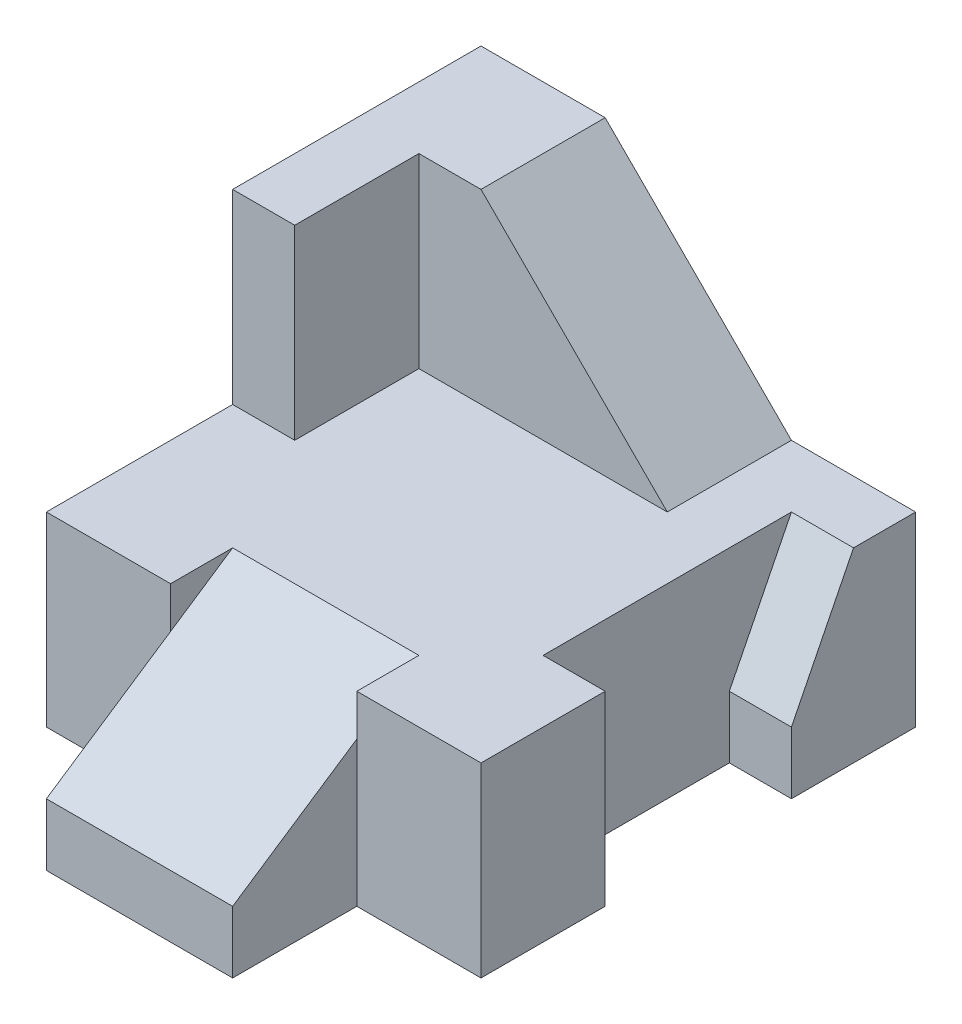
ISO-10303-21;
HEADER;
FILE_DESCRIPTION(('STEP AP214'),'2;1');
FILE_NAME('part.step','',(''),(''),'','','');
FILE_SCHEMA(('AUTOMOTIVE_DESIGN { 1 0 10303 214 1 1 1 1 }'));
ENDSEC;
DATA;
#1=APPLICATION_CONTEXT('core data for automotive mechanical design processes');
#2=APPLICATION_PROTOCOL_DEFINITION('international standard','automotive_design',2000,#1);
#3=PRODUCT_CONTEXT('',#1,'mechanical');
#4=PRODUCT('Part','Part','',(#3));
#5=PRODUCT_RELATED_PRODUCT_CATEGORY('part','',(#4));
#6=PRODUCT_DEFINITION_FORMATION('','',#4);
#7=PRODUCT_DEFINITION_CONTEXT('part definition',#1,'design');
#8=PRODUCT_DEFINITION('design','',#6,#7);
#9=PRODUCT_DEFINITION_SHAPE('','',#8);
#10=(LENGTH_UNIT() NAMED_UNIT(*) SI_UNIT(.MILLI.,.METRE.));
#11=(NAMED_UNIT(*) PLANE_ANGLE_UNIT() SI_UNIT($,.RADIAN.));
#12=(NAMED_UNIT(*) SI_UNIT($,.STERADIAN.) SOLID_ANGLE_UNIT());
#13=UNCERTAINTY_MEASURE_WITH_UNIT(LENGTH_MEASURE(1.E-05),#10,'distance_accuracy_value','');
#14=(GEOMETRIC_REPRESENTATION_CONTEXT(3) GLOBAL_UNCERTAINTY_ASSIGNED_CONTEXT((#13)) GLOBAL_UNIT_ASSIGNED_CONTEXT((#10,
#11,#12)) REPRESENTATION_CONTEXT('',''));
#15=CARTESIAN_POINT('',(0.,0.,0.));
#16=DIRECTION('',(0.,0.,1.));
#17=DIRECTION('',(1.,0.,0.));
#18=AXIS2_PLACEMENT_3D('',#15,#16,#17);
#19=CARTESIAN_POINT('',(0.,0.,9.));
#20=DIRECTION('',(0.,0.,1.));
#21=DIRECTION('',(1.,0.,0.));
#22=AXIS2_PLACEMENT_3D('',#19,#20,#21);
#23=PLANE('',#22);
#24=DIRECTION('',(0.,1.,0.));
#25=VECTOR('',#24,1.);
#26=CARTESIAN_POINT('',(1.5,-3.,9.));
#27=LINE('',#26,#25);
#28=CARTESIAN_POINT('',(1.5,-3.,9.));
#29=VERTEX_POINT('',#28);
#30=CARTESIAN_POINT('',(1.5,-2.,9.));
#31=VERTEX_POINT('',#30);
#32=EDGE_CURVE('E229',#29,#31,#27,.T.);
#33=ORIENTED_EDGE('',*,*,#32,.T.);
#34=DIRECTION('',(1.,0.,0.));
#35=VECTOR('',#34,1.);
#36=CARTESIAN_POINT('',(-1.5,-2.,9.));
#37=LINE('',#36,#35);
#38=CARTESIAN_POINT('',(-1.5,-2.,9.));
#39=VERTEX_POINT('',#38);
#40=EDGE_CURVE('E184',#39,#31,#37,.T.);
#41=ORIENTED_EDGE('',*,*,#40,.F.);
#42=DIRECTION('',(0.,1.,0.));
#43=VECTOR('',#42,1.);
#44=CARTESIAN_POINT('',(-1.5,-3.,9.));
#45=LINE('',#44,#43);
#46=CARTESIAN_POINT('',(-1.5,-3.,9.));
#47=VERTEX_POINT('',#46);
#48=EDGE_CURVE('E215',#47,#39,#45,.T.);
#49=ORIENTED_EDGE('',*,*,#48,.F.);
#50=DIRECTION('',(1.,0.,0.));
#51=VECTOR('',#50,1.);
#52=CARTESIAN_POINT('',(3.5,-3.,9.));
#53=LINE('',#52,#51);
#54=EDGE_CURVE('E201',#47,#29,#53,.T.);
#55=ORIENTED_EDGE('',*,*,#54,.T.);
#56=EDGE_LOOP('',(#33,#41,#49,#55));
#57=FACE_BOUND('',#56,.T.);
#58=ADVANCED_FACE('F34',(#57),#23,.T.);
#59=CARTESIAN_POINT('',(-1.5,-3.,7.));
#60=DIRECTION('',(1.,0.,0.));
#61=DIRECTION('',(0.,1.,0.));
#62=AXIS2_PLACEMENT_3D('',#59,#60,#61);
#63=PLANE('',#62);
#64=DIRECTION('',(0.,-0.554700196225229,0.832050294337843));
#65=VECTOR('',#64,1.);
#66=CARTESIAN_POINT('',(-1.5,0.,6.));
#67=LINE('',#66,#65);
#68=CARTESIAN_POINT('',(-1.5,-0.666666666666666,7.));
#69=VERTEX_POINT('',#68);
#70=EDGE_CURVE('E177',#69,#39,#67,.T.);
#71=ORIENTED_EDGE('',*,*,#70,.F.);
#72=DIRECTION('',(0.,1.,0.));
#73=VECTOR('',#72,1.);
#74=CARTESIAN_POINT('',(-1.5,-3.,7.));
#75=LINE('',#74,#73);
#76=CARTESIAN_POINT('',(-1.5,-3.,7.));
#77=VERTEX_POINT('',#76);
#78=EDGE_CURVE('E218',#77,#69,#75,.T.);
#79=ORIENTED_EDGE('',*,*,#78,.F.);
#80=DIRECTION('',(0.,0.,-1.));
#81=VECTOR('',#80,1.);
#82=CARTESIAN_POINT('',(-1.5,-3.,7.));
#83=LINE('',#82,#81);
#84=EDGE_CURVE('E226',#47,#77,#83,.T.);
#85=ORIENTED_EDGE('',*,*,#84,.F.);
#86=ORIENTED_EDGE('',*,*,#48,.T.);
#87=EDGE_LOOP('',(#71,#79,#85,#86));
#88=FACE_BOUND('',#87,.T.);
#89=ADVANCED_FACE('F390',(#88),#63,.F.);
#90=CARTESIAN_POINT('',(1.5,-3.,7.));
#91=DIRECTION('',(-1.,0.,0.));
#92=DIRECTION('',(0.,-1.,0.));
#93=AXIS2_PLACEMENT_3D('',#90,#91,#92);
#94=PLANE('',#93);
#95=DIRECTION('',(0.,0.554700196225229,-0.832050294337843));
#96=VECTOR('',#95,1.);
#97=CARTESIAN_POINT('',(1.5,-2.,9.));
#98=LINE('',#97,#96);
#99=CARTESIAN_POINT('',(1.5,-0.666666666666666,7.));
#100=VERTEX_POINT('',#99);
#101=EDGE_CURVE('E178',#31,#100,#98,.T.);
#102=ORIENTED_EDGE('',*,*,#101,.F.);
#103=ORIENTED_EDGE('',*,*,#32,.F.);
#104=DIRECTION('',(0.,0.,1.));
#105=VECTOR('',#104,1.);
#106=CARTESIAN_POINT('',(1.5,-3.,7.));
#107=LINE('',#106,#105);
#108=CARTESIAN_POINT('',(1.5,-3.,7.));
#109=VERTEX_POINT('',#108);
#110=EDGE_CURVE('E234',#109,#29,#107,.T.);
#111=ORIENTED_EDGE('',*,*,#110,.F.);
#112=DIRECTION('',(0.,1.,0.));
#113=VECTOR('',#112,1.);
#114=CARTESIAN_POINT('',(1.5,-3.,7.));
#115=LINE('',#114,#113);
#116=EDGE_CURVE('E233',#109,#100,#115,.T.);
#117=ORIENTED_EDGE('',*,*,#116,.T.);
#118=EDGE_LOOP('',(#102,#103,#111,#117));
#119=FACE_BOUND('',#118,.T.);
#120=ADVANCED_FACE('F335',(#119),#94,.F.);
#121=CARTESIAN_POINT('',(0.,0.,4.5));
#122=DIRECTION('',(0.,1.,0.));
#123=DIRECTION('',(-1.,0.,0.));
#124=AXIS2_PLACEMENT_3D('',#121,#122,#123);
#125=PLANE('',#124);
#126=DIRECTION('',(-1.,0.,0.));
#127=VECTOR('',#126,1.);
#128=CARTESIAN_POINT('',(1.5,0.,6.));
#129=LINE('',#128,#127);
#130=CARTESIAN_POINT('',(1.5,0.,6.));
#131=VERTEX_POINT('',#130);
#132=CARTESIAN_POINT('',(-1.5,0.,6.));
#133=VERTEX_POINT('',#132);
#134=EDGE_CURVE('E171',#131,#133,#129,.T.);
#135=ORIENTED_EDGE('',*,*,#134,.F.);
#136=DIRECTION('',(0.,0.,1.));
#137=VECTOR('',#136,1.);
#138=CARTESIAN_POINT('',(1.5,0.,4.5));
#139=LINE('',#138,#137);
#140=CARTESIAN_POINT('',(1.5,0.,7.));
#141=VERTEX_POINT('',#140);
#142=EDGE_CURVE('E12',#131,#141,#139,.T.);
#143=ORIENTED_EDGE('',*,*,#142,.T.);
#144=DIRECTION('',(1.,0.,0.));
#145=VECTOR('',#144,1.);
#146=CARTESIAN_POINT('',(3.5,0.,7.));
#147=LINE('',#146,#145);
#148=CARTESIAN_POINT('',(3.5,0.,7.));
#149=VERTEX_POINT('',#148);
#150=EDGE_CURVE('E271',#141,#149,#147,.T.);
#151=ORIENTED_EDGE('',*,*,#150,.T.);
#152=DIRECTION('',(0.,0.,-1.));
#153=VECTOR('',#152,1.);
#154=CARTESIAN_POINT('',(3.5,0.,9.));
#155=LINE('',#154,#153);
#156=CARTESIAN_POINT('',(3.5,0.,5.));
#157=VERTEX_POINT('',#156);
#158=EDGE_CURVE('E273',#149,#157,#155,.T.);
#159=ORIENTED_EDGE('',*,*,#158,.T.);
#160=DIRECTION('',(-1.,0.,0.));
#161=VECTOR('',#160,1.);
#162=CARTESIAN_POINT('',(2.5,0.,5.));
#163=LINE('',#162,#161);
#164=CARTESIAN_POINT('',(2.5,0.,5.));
#165=VERTEX_POINT('',#164);
#166=EDGE_CURVE('E277',#157,#165,#163,.T.);
#167=ORIENTED_EDGE('',*,*,#166,.T.);
#168=DIRECTION('',(0.,0.,-1.));
#169=VECTOR('',#168,1.);
#170=CARTESIAN_POINT('',(2.5,0.,2.));
#171=LINE('',#170,#169);
#172=CARTESIAN_POINT('',(2.5,0.,1.));
#173=VERTEX_POINT('',#172);
#174=EDGE_CURVE('E57',#165,#173,#171,.T.);
#175=ORIENTED_EDGE('',*,*,#174,.T.);
#176=DIRECTION('',(1.,0.,0.));
#177=VECTOR('',#176,1.);
#178=CARTESIAN_POINT('',(2.5,0.,1.));
#179=LINE('',#178,#177);
#180=CARTESIAN_POINT('',(3.5,0.,1.));
#181=VERTEX_POINT('',#180);
#182=EDGE_CURVE('E314',#173,#181,#179,.T.);
#183=ORIENTED_EDGE('',*,*,#182,.T.);
#184=DIRECTION('',(0.,0.,-1.));
#185=VECTOR('',#184,1.);
#186=CARTESIAN_POINT('',(3.5,0.,9.));
#187=LINE('',#186,#185);
#188=CARTESIAN_POINT('',(3.5,0.,0.));
#189=VERTEX_POINT('',#188);
#190=EDGE_CURVE('E275',#181,#189,#187,.T.);
#191=ORIENTED_EDGE('',*,*,#190,.T.);
#192=DIRECTION('',(-1.,0.,0.));
#193=VECTOR('',#192,1.);
#194=CARTESIAN_POINT('',(0.,0.,0.));
#195=LINE('',#194,#193);
#196=CARTESIAN_POINT('',(1.5,0.,0.));
#197=VERTEX_POINT('',#196);
#198=EDGE_CURVE('E268',#189,#197,#195,.T.);
#199=ORIENTED_EDGE('',*,*,#198,.T.);
#200=DIRECTION('',(0.,0.,-1.));
#201=VECTOR('',#200,1.);
#202=CARTESIAN_POINT('',(1.5,0.,0.));
#203=LINE('',#202,#201);
#204=CARTESIAN_POINT('',(1.5,0.,2.));
#205=VERTEX_POINT('',#204);
#206=EDGE_CURVE('E285',#205,#197,#203,.T.);
#207=ORIENTED_EDGE('',*,*,#206,.F.);
#208=DIRECTION('',(1.,0.,0.));
#209=VECTOR('',#208,1.);
#210=CARTESIAN_POINT('',(1.5,0.,2.));
#211=LINE('',#210,#209);
#212=CARTESIAN_POINT('',(-2.5,0.,2.));
#213=VERTEX_POINT('',#212);
#214=EDGE_CURVE('E300',#213,#205,#211,.T.);
#215=ORIENTED_EDGE('',*,*,#214,.F.);
#216=DIRECTION('',(0.,0.,-1.));
#217=VECTOR('',#216,1.);
#218=CARTESIAN_POINT('',(-2.5,0.,2.));
#219=LINE('',#218,#217);
#220=CARTESIAN_POINT('',(-2.5,0.,4.));
#221=VERTEX_POINT('',#220);
#222=EDGE_CURVE('E303',#221,#213,#219,.T.);
#223=ORIENTED_EDGE('',*,*,#222,.F.);
#224=DIRECTION('',(1.,0.,0.));
#225=VECTOR('',#224,1.);
#226=CARTESIAN_POINT('',(-2.5,0.,4.));
#227=LINE('',#226,#225);
#228=CARTESIAN_POINT('',(-3.5,0.,4.));
#229=VERTEX_POINT('',#228);
#230=EDGE_CURVE('E291',#229,#221,#227,.T.);
#231=ORIENTED_EDGE('',*,*,#230,.F.);
#232=DIRECTION('',(0.,0.,1.));
#233=VECTOR('',#232,1.);
#234=CARTESIAN_POINT('',(-3.5,0.,9.));
#235=LINE('',#234,#233);
#236=CARTESIAN_POINT('',(-3.5,0.,7.));
#237=VERTEX_POINT('',#236);
#238=EDGE_CURVE('E265',#229,#237,#235,.T.);
#239=ORIENTED_EDGE('',*,*,#238,.T.);
#240=DIRECTION('',(1.,0.,0.));
#241=VECTOR('',#240,1.);
#242=CARTESIAN_POINT('',(-3.5,0.,7.));
#243=LINE('',#242,#241);
#244=CARTESIAN_POINT('',(-1.5,0.,7.));
#245=VERTEX_POINT('',#244);
#246=EDGE_CURVE('E189',#237,#245,#243,.T.);
#247=ORIENTED_EDGE('',*,*,#246,.T.);
#248=DIRECTION('',(0.,0.,-1.));
#249=VECTOR('',#248,1.);
#250=CARTESIAN_POINT('',(-1.5,0.,4.5));
#251=LINE('',#250,#249);
#252=EDGE_CURVE('E42',#245,#133,#251,.T.);
#253=ORIENTED_EDGE('',*,*,#252,.T.);
#254=EDGE_LOOP('',(#135,#143,#151,#159,#167,#175,#183,#191,#199,#207,#215,#223,#231,#239,#247,#253));
#255=FACE_BOUND('',#254,.T.);
#256=ADVANCED_FACE('F187',(#255),#125,.T.);
#257=CARTESIAN_POINT('',(3.5,-3.,9.));
#258=DIRECTION('',(-1.,0.,0.));
#259=DIRECTION('',(0.,0.,1.));
#260=AXIS2_PLACEMENT_3D('',#257,#258,#259);
#261=PLANE('',#260);
#262=ORIENTED_EDGE('',*,*,#158,.F.);
#263=DIRECTION('',(0.,1.,0.));
#264=VECTOR('',#263,1.);
#265=CARTESIAN_POINT('',(3.5,-3.,7.));
#266=LINE('',#265,#264);
#267=CARTESIAN_POINT('',(3.5,-3.,7.));
#268=VERTEX_POINT('',#267);
#269=EDGE_CURVE('E230',#268,#149,#266,.T.);
#270=ORIENTED_EDGE('',*,*,#269,.F.);
#271=DIRECTION('',(0.,0.,-1.));
#272=VECTOR('',#271,1.);
#273=CARTESIAN_POINT('',(3.5,-3.,9.));
#274=LINE('',#273,#272);
#275=CARTESIAN_POINT('',(3.5,-3.,5.));
#276=VERTEX_POINT('',#275);
#277=EDGE_CURVE('E192',#268,#276,#274,.T.);
#278=ORIENTED_EDGE('',*,*,#277,.T.);
#279=DIRECTION('',(0.,1.,0.));
#280=VECTOR('',#279,1.);
#281=CARTESIAN_POINT('',(3.5,-3.,5.));
#282=LINE('',#281,#280);
#283=EDGE_CURVE('E244',#276,#157,#282,.T.);
#284=ORIENTED_EDGE('',*,*,#283,.T.);
#285=EDGE_LOOP('',(#262,#270,#278,#284));
#286=FACE_BOUND('',#285,.T.);
#287=ADVANCED_FACE('F343',(#286),#261,.F.);
#288=CARTESIAN_POINT('',(-3.5,-3.,9.));
#289=DIRECTION('',(1.,0.,0.));
#290=DIRECTION('',(0.,0.,-1.));
#291=AXIS2_PLACEMENT_3D('',#288,#289,#290);
#292=PLANE('',#291);
#293=DIRECTION('',(0.,-1.,0.));
#294=VECTOR('',#293,1.);
#295=CARTESIAN_POINT('',(-3.5,-3.,0.));
#296=LINE('',#295,#294);
#297=CARTESIAN_POINT('',(-3.5,3.,0.));
#298=VERTEX_POINT('',#297);
#299=CARTESIAN_POINT('',(-3.5,-3.,0.));
#300=VERTEX_POINT('',#299);
#301=EDGE_CURVE('E210',#298,#300,#296,.T.);
#302=ORIENTED_EDGE('',*,*,#301,.T.);
#303=DIRECTION('',(0.,0.,-1.));
#304=VECTOR('',#303,1.);
#305=CARTESIAN_POINT('',(-3.5,-3.,9.));
#306=LINE('',#305,#304);
#307=CARTESIAN_POINT('',(-3.5,-3.,7.));
#308=VERTEX_POINT('',#307);
#309=EDGE_CURVE('E190',#308,#300,#306,.T.);
#310=ORIENTED_EDGE('',*,*,#309,.F.);
#311=DIRECTION('',(0.,1.,0.));
#312=VECTOR('',#311,1.);
#313=CARTESIAN_POINT('',(-3.5,-3.,7.));
#314=LINE('',#313,#312);
#315=EDGE_CURVE('E212',#308,#237,#314,.T.);
#316=ORIENTED_EDGE('',*,*,#315,.T.);
#317=ORIENTED_EDGE('',*,*,#238,.F.);
#318=DIRECTION('',(0.,1.,0.));
#319=VECTOR('',#318,1.);
#320=CARTESIAN_POINT('',(-3.5,0.,4.));
#321=LINE('',#320,#319);
#322=CARTESIAN_POINT('',(-3.5,3.,4.));
#323=VERTEX_POINT('',#322);
#324=EDGE_CURVE('E281',#229,#323,#321,.T.);
#325=ORIENTED_EDGE('',*,*,#324,.T.);
#326=DIRECTION('',(0.,0.,-1.));
#327=VECTOR('',#326,1.);
#328=CARTESIAN_POINT('',(-3.5,3.,9.));
#329=LINE('',#328,#327);
#330=EDGE_CURVE('E198',#323,#298,#329,.T.);
#331=ORIENTED_EDGE('',*,*,#330,.T.);
#332=EDGE_LOOP('',(#302,#310,#316,#317,#325,#331));
#333=FACE_BOUND('',#332,.T.);
#334=ADVANCED_FACE('F36',(#333),#292,.F.);
#335=ORIENTED_EDGE('',*,*,#190,.F.);
#336=DIRECTION('',(0.,0.894427190999916,-0.447213595499958));
#337=VECTOR('',#336,1.);
#338=CARTESIAN_POINT('',(3.5,0.,1.));
#339=LINE('',#338,#337);
#340=CARTESIAN_POINT('',(3.5,-2.,2.));
#341=VERTEX_POINT('',#340);
#342=EDGE_CURVE('E319',#341,#181,#339,.T.);
#343=ORIENTED_EDGE('',*,*,#342,.F.);
#344=DIRECTION('',(0.,1.,0.));
#345=VECTOR('',#344,1.);
#346=CARTESIAN_POINT('',(3.5,-3.,2.));
#347=LINE('',#346,#345);
#348=CARTESIAN_POINT('',(3.5,-3.,2.));
#349=VERTEX_POINT('',#348);
#350=EDGE_CURVE('E245',#349,#341,#347,.T.);
#351=ORIENTED_EDGE('',*,*,#350,.F.);
#352=CARTESIAN_POINT('',(3.5,-3.,0.));
#353=VERTEX_POINT('',#352);
#354=EDGE_CURVE('E197',#349,#353,#274,.T.);
#355=ORIENTED_EDGE('',*,*,#354,.T.);
#356=DIRECTION('',(0.,1.,0.));
#357=VECTOR('',#356,1.);
#358=CARTESIAN_POINT('',(3.5,-3.,0.));
#359=LINE('',#358,#357);
#360=EDGE_CURVE('E204',#353,#189,#359,.T.);
#361=ORIENTED_EDGE('',*,*,#360,.T.);
#362=EDGE_LOOP('',(#335,#343,#351,#355,#361));
#363=FACE_BOUND('',#362,.T.);
#364=ADVANCED_FACE('F359',(#363),#261,.F.);
#365=CARTESIAN_POINT('',(3.5,3.,9.));
#366=DIRECTION('',(0.,-1.,0.));
#367=DIRECTION('',(1.,0.,0.));
#368=AXIS2_PLACEMENT_3D('',#365,#366,#367);
#369=PLANE('',#368);
#370=DIRECTION('',(1.,0.,0.));
#371=VECTOR('',#370,1.);
#372=CARTESIAN_POINT('',(1.5,3.,2.));
#373=LINE('',#372,#371);
#374=CARTESIAN_POINT('',(-2.5,3.,2.));
#375=VERTEX_POINT('',#374);
#376=CARTESIAN_POINT('',(-1.5,3.,2.));
#377=VERTEX_POINT('',#376);
#378=EDGE_CURVE('E288',#375,#377,#373,.T.);
#379=ORIENTED_EDGE('',*,*,#378,.T.);
#380=DIRECTION('',(0.,0.,1.));
#381=VECTOR('',#380,1.);
#382=CARTESIAN_POINT('',(-1.5,3.,-1.));
#383=LINE('',#382,#381);
#384=CARTESIAN_POINT('',(-1.5,3.,0.));
#385=VERTEX_POINT('',#384);
#386=EDGE_CURVE('E310',#385,#377,#383,.T.);
#387=ORIENTED_EDGE('',*,*,#386,.F.);
#388=DIRECTION('',(-1.,0.,0.));
#389=VECTOR('',#388,1.);
#390=CARTESIAN_POINT('',(3.5,3.,0.));
#391=LINE('',#390,#389);
#392=EDGE_CURVE('E202',#385,#298,#391,.T.);
#393=ORIENTED_EDGE('',*,*,#392,.T.);
#394=ORIENTED_EDGE('',*,*,#330,.F.);
#395=DIRECTION('',(1.,0.,0.));
#396=VECTOR('',#395,1.);
#397=CARTESIAN_POINT('',(-2.5,3.,4.));
#398=LINE('',#397,#396);
#399=CARTESIAN_POINT('',(-2.5,3.,4.));
#400=VERTEX_POINT('',#399);
#401=EDGE_CURVE('E295',#323,#400,#398,.T.);
#402=ORIENTED_EDGE('',*,*,#401,.T.);
#403=DIRECTION('',(0.,0.,-1.));
#404=VECTOR('',#403,1.);
#405=CARTESIAN_POINT('',(-2.5,3.,2.));
#406=LINE('',#405,#404);
#407=EDGE_CURVE('E292',#400,#375,#406,.T.);
#408=ORIENTED_EDGE('',*,*,#407,.T.);
#409=EDGE_LOOP('',(#379,#387,#393,#394,#402,#408));
#410=FACE_BOUND('',#409,.T.);
#411=ADVANCED_FACE('F395',(#410),#369,.F.);
#412=CARTESIAN_POINT('',(-3.5,-3.,7.));
#413=DIRECTION('',(0.,0.,-1.));
#414=DIRECTION('',(-1.,0.,0.));
#415=AXIS2_PLACEMENT_3D('',#412,#413,#414);
#416=PLANE('',#415);
#417=ORIENTED_EDGE('',*,*,#246,.F.);
#418=ORIENTED_EDGE('',*,*,#315,.F.);
#419=DIRECTION('',(-1.,0.,0.));
#420=VECTOR('',#419,1.);
#421=CARTESIAN_POINT('',(-3.5,-3.,7.));
#422=LINE('',#421,#420);
#423=EDGE_CURVE('E219',#77,#308,#422,.T.);
#424=ORIENTED_EDGE('',*,*,#423,.F.);
#425=ORIENTED_EDGE('',*,*,#78,.T.);
#426=DIRECTION('',(0.,-1.,0.));
#427=VECTOR('',#426,1.);
#428=CARTESIAN_POINT('',(-1.5,-3.,7.));
#429=LINE('',#428,#427);
#430=EDGE_CURVE('E183',#245,#69,#429,.T.);
#431=ORIENTED_EDGE('',*,*,#430,.F.);
#432=EDGE_LOOP('',(#417,#418,#424,#425,#431));
#433=FACE_BOUND('',#432,.T.);
#434=ADVANCED_FACE('F387',(#433),#416,.F.);
#435=CARTESIAN_POINT('',(3.5,-3.,7.));
#436=DIRECTION('',(0.,0.,-1.));
#437=DIRECTION('',(-1.,0.,0.));
#438=AXIS2_PLACEMENT_3D('',#435,#436,#437);
#439=PLANE('',#438);
#440=ORIENTED_EDGE('',*,*,#150,.F.);
#441=DIRECTION('',(0.,1.,0.));
#442=VECTOR('',#441,1.);
#443=CARTESIAN_POINT('',(1.5,-3.,7.));
#444=LINE('',#443,#442);
#445=EDGE_CURVE('E321',#100,#141,#444,.T.);
#446=ORIENTED_EDGE('',*,*,#445,.F.);
#447=ORIENTED_EDGE('',*,*,#116,.F.);
#448=DIRECTION('',(-1.,0.,0.));
#449=VECTOR('',#448,1.);
#450=CARTESIAN_POINT('',(3.5,-3.,7.));
#451=LINE('',#450,#449);
#452=EDGE_CURVE('E241',#268,#109,#451,.T.);
#453=ORIENTED_EDGE('',*,*,#452,.F.);
#454=ORIENTED_EDGE('',*,*,#269,.T.);
#455=EDGE_LOOP('',(#440,#446,#447,#453,#454));
#456=FACE_BOUND('',#455,.T.);
#457=ADVANCED_FACE('F332',(#456),#439,.F.);
#458=CARTESIAN_POINT('',(2.5,-3.,5.));
#459=DIRECTION('',(0.,0.,1.));
#460=DIRECTION('',(1.,0.,0.));
#461=AXIS2_PLACEMENT_3D('',#458,#459,#460);
#462=PLANE('',#461);
#463=ORIENTED_EDGE('',*,*,#166,.F.);
#464=ORIENTED_EDGE('',*,*,#283,.F.);
#465=DIRECTION('',(1.,0.,0.));
#466=VECTOR('',#465,1.);
#467=CARTESIAN_POINT('',(2.5,-3.,5.));
#468=LINE('',#467,#466);
#469=CARTESIAN_POINT('',(2.5,-3.,5.));
#470=VERTEX_POINT('',#469);
#471=EDGE_CURVE('E249',#470,#276,#468,.T.);
#472=ORIENTED_EDGE('',*,*,#471,.F.);
#473=DIRECTION('',(0.,1.,0.));
#474=VECTOR('',#473,1.);
#475=CARTESIAN_POINT('',(2.5,-3.,5.));
#476=LINE('',#475,#474);
#477=EDGE_CURVE('E252',#470,#165,#476,.T.);
#478=ORIENTED_EDGE('',*,*,#477,.T.);
#479=EDGE_LOOP('',(#463,#464,#472,#478));
#480=FACE_BOUND('',#479,.T.);
#481=ADVANCED_FACE('F346',(#480),#462,.F.);
#482=CARTESIAN_POINT('',(2.5,-3.,2.));
#483=DIRECTION('',(-1.,0.,0.));
#484=DIRECTION('',(0.,0.,1.));
#485=AXIS2_PLACEMENT_3D('',#482,#483,#484);
#486=PLANE('',#485);
#487=ORIENTED_EDGE('',*,*,#174,.F.);
#488=ORIENTED_EDGE('',*,*,#477,.F.);
#489=DIRECTION('',(0.,0.,1.));
#490=VECTOR('',#489,1.);
#491=CARTESIAN_POINT('',(2.5,-3.,2.));
#492=LINE('',#491,#490);
#493=CARTESIAN_POINT('',(2.5,-3.,2.));
#494=VERTEX_POINT('',#493);
#495=EDGE_CURVE('E259',#494,#470,#492,.T.);
#496=ORIENTED_EDGE('',*,*,#495,.F.);
#497=DIRECTION('',(0.,1.,0.));
#498=VECTOR('',#497,1.);
#499=CARTESIAN_POINT('',(2.5,-3.,2.));
#500=LINE('',#499,#498);
#501=CARTESIAN_POINT('',(2.5,-2.,2.));
#502=VERTEX_POINT('',#501);
#503=EDGE_CURVE('E248',#494,#502,#500,.T.);
#504=ORIENTED_EDGE('',*,*,#503,.T.);
#505=DIRECTION('',(0.,0.894427190999916,-0.447213595499958));
#506=VECTOR('',#505,1.);
#507=CARTESIAN_POINT('',(2.5,0.,1.));
#508=LINE('',#507,#506);
#509=EDGE_CURVE('E317',#502,#173,#508,.T.);
#510=ORIENTED_EDGE('',*,*,#509,.T.);
#511=EDGE_LOOP('',(#487,#488,#496,#504,#510));
#512=FACE_BOUND('',#511,.T.);
#513=ADVANCED_FACE('F350',(#512),#486,.F.);
#514=CARTESIAN_POINT('',(3.5,-3.,2.));
#515=DIRECTION('',(0.,0.,-1.));
#516=DIRECTION('',(-1.,0.,0.));
#517=AXIS2_PLACEMENT_3D('',#514,#515,#516);
#518=PLANE('',#517);
#519=ORIENTED_EDGE('',*,*,#350,.T.);
#520=DIRECTION('',(1.,0.,0.));
#521=VECTOR('',#520,1.);
#522=CARTESIAN_POINT('',(2.5,-2.,2.));
#523=LINE('',#522,#521);
#524=EDGE_CURVE('E315',#502,#341,#523,.T.);
#525=ORIENTED_EDGE('',*,*,#524,.F.);
#526=ORIENTED_EDGE('',*,*,#503,.F.);
#527=DIRECTION('',(-1.,0.,0.));
#528=VECTOR('',#527,1.);
#529=CARTESIAN_POINT('',(3.5,-3.,2.));
#530=LINE('',#529,#528);
#531=EDGE_CURVE('E262',#349,#494,#530,.T.);
#532=ORIENTED_EDGE('',*,*,#531,.F.);
#533=EDGE_LOOP('',(#519,#525,#526,#532));
#534=FACE_BOUND('',#533,.T.);
#535=ADVANCED_FACE('F421',(#534),#518,.F.);
#536=CARTESIAN_POINT('',(3.5,-3.,9.));
#537=DIRECTION('',(0.,1.,0.));
#538=DIRECTION('',(-1.,0.,0.));
#539=AXIS2_PLACEMENT_3D('',#536,#537,#538);
#540=PLANE('',#539);
#541=ORIENTED_EDGE('',*,*,#495,.T.);
#542=ORIENTED_EDGE('',*,*,#471,.T.);
#543=ORIENTED_EDGE('',*,*,#277,.F.);
#544=ORIENTED_EDGE('',*,*,#452,.T.);
#545=ORIENTED_EDGE('',*,*,#110,.T.);
#546=ORIENTED_EDGE('',*,*,#54,.F.);
#547=ORIENTED_EDGE('',*,*,#84,.T.);
#548=ORIENTED_EDGE('',*,*,#423,.T.);
#549=ORIENTED_EDGE('',*,*,#309,.T.);
#550=DIRECTION('',(1.,0.,0.));
#551=VECTOR('',#550,1.);
#552=CARTESIAN_POINT('',(3.5,-3.,0.));
#553=LINE('',#552,#551);
#554=EDGE_CURVE('E207',#300,#353,#553,.T.);
#555=ORIENTED_EDGE('',*,*,#554,.T.);
#556=ORIENTED_EDGE('',*,*,#354,.F.);
#557=ORIENTED_EDGE('',*,*,#531,.T.);
#558=EDGE_LOOP('',(#541,#542,#543,#544,#545,#546,#547,#548,#549,#555,#556,#557));
#559=FACE_BOUND('',#558,.T.);
#560=ADVANCED_FACE('F339',(#559),#540,.F.);
#561=CARTESIAN_POINT('',(0.,0.,0.));
#562=DIRECTION('',(0.,0.,1.));
#563=DIRECTION('',(1.,0.,0.));
#564=AXIS2_PLACEMENT_3D('',#561,#562,#563);
#565=PLANE('',#564);
#566=ORIENTED_EDGE('',*,*,#392,.F.);
#567=DIRECTION('',(0.707106781186548,-0.707106781186547,0.));
#568=VECTOR('',#567,1.);
#569=CARTESIAN_POINT('',(0.749999999999999,0.75,0.));
#570=LINE('',#569,#568);
#571=EDGE_CURVE('E298',#385,#197,#570,.T.);
#572=ORIENTED_EDGE('',*,*,#571,.T.);
#573=ORIENTED_EDGE('',*,*,#198,.F.);
#574=ORIENTED_EDGE('',*,*,#360,.F.);
#575=ORIENTED_EDGE('',*,*,#554,.F.);
#576=ORIENTED_EDGE('',*,*,#301,.F.);
#577=EDGE_LOOP('',(#566,#572,#573,#574,#575,#576));
#578=FACE_BOUND('',#577,.T.);
#579=ADVANCED_FACE('F366',(#578),#565,.F.);
#580=CARTESIAN_POINT('',(1.5,0.,2.));
#581=DIRECTION('',(0.,0.,1.));
#582=DIRECTION('',(1.,0.,0.));
#583=AXIS2_PLACEMENT_3D('',#580,#581,#582);
#584=PLANE('',#583);
#585=DIRECTION('',(0.707106781186548,-0.707106781186547,0.));
#586=VECTOR('',#585,1.);
#587=CARTESIAN_POINT('',(-1.5,3.,2.));
#588=LINE('',#587,#586);
#589=EDGE_CURVE('E312',#377,#205,#588,.T.);
#590=ORIENTED_EDGE('',*,*,#589,.F.);
#591=ORIENTED_EDGE('',*,*,#378,.F.);
#592=DIRECTION('',(0.,1.,0.));
#593=VECTOR('',#592,1.);
#594=CARTESIAN_POINT('',(-2.5,0.,2.));
#595=LINE('',#594,#593);
#596=EDGE_CURVE('E280',#213,#375,#595,.T.);
#597=ORIENTED_EDGE('',*,*,#596,.F.);
#598=ORIENTED_EDGE('',*,*,#214,.T.);
#599=EDGE_LOOP('',(#590,#591,#597,#598));
#600=FACE_BOUND('',#599,.T.);
#601=ADVANCED_FACE('F374',(#600),#584,.T.);
#602=CARTESIAN_POINT('',(-2.5,0.,2.));
#603=DIRECTION('',(1.,0.,0.));
#604=DIRECTION('',(0.,0.,-1.));
#605=AXIS2_PLACEMENT_3D('',#602,#603,#604);
#606=PLANE('',#605);
#607=ORIENTED_EDGE('',*,*,#407,.F.);
#608=DIRECTION('',(0.,1.,0.));
#609=VECTOR('',#608,1.);
#610=CARTESIAN_POINT('',(-2.5,0.,4.));
#611=LINE('',#610,#609);
#612=EDGE_CURVE('E284',#221,#400,#611,.T.);
#613=ORIENTED_EDGE('',*,*,#612,.F.);
#614=ORIENTED_EDGE('',*,*,#222,.T.);
#615=ORIENTED_EDGE('',*,*,#596,.T.);
#616=EDGE_LOOP('',(#607,#613,#614,#615));
#617=FACE_BOUND('',#616,.T.);
#618=ADVANCED_FACE('F378',(#617),#606,.T.);
#619=CARTESIAN_POINT('',(-2.5,0.,4.));
#620=DIRECTION('',(0.,0.,1.));
#621=DIRECTION('',(1.,0.,0.));
#622=AXIS2_PLACEMENT_3D('',#619,#620,#621);
#623=PLANE('',#622);
#624=ORIENTED_EDGE('',*,*,#401,.F.);
#625=ORIENTED_EDGE('',*,*,#324,.F.);
#626=ORIENTED_EDGE('',*,*,#230,.T.);
#627=ORIENTED_EDGE('',*,*,#612,.T.);
#628=EDGE_LOOP('',(#624,#625,#626,#627));
#629=FACE_BOUND('',#628,.T.);
#630=ADVANCED_FACE('F381',(#629),#623,.T.);
#631=CARTESIAN_POINT('',(-1.5,3.,-1.));
#632=DIRECTION('',(-0.707106781186547,-0.707106781186548,0.));
#633=DIRECTION('',(0.707106781186548,-0.707106781186547,0.));
#634=AXIS2_PLACEMENT_3D('',#631,#632,#633);
#635=PLANE('',#634);
#636=ORIENTED_EDGE('',*,*,#386,.T.);
#637=ORIENTED_EDGE('',*,*,#589,.T.);
#638=ORIENTED_EDGE('',*,*,#206,.T.);
#639=ORIENTED_EDGE('',*,*,#571,.F.);
#640=EDGE_LOOP('',(#636,#637,#638,#639));
#641=FACE_BOUND('',#640,.T.);
#642=ADVANCED_FACE('F396',(#641),#635,.F.);
#643=CARTESIAN_POINT('',(2.5,0.,1.));
#644=DIRECTION('',(0.,-0.447213595499958,-0.894427190999916));
#645=DIRECTION('',(0.,0.894427190999916,-0.447213595499958));
#646=AXIS2_PLACEMENT_3D('',#643,#644,#645);
#647=PLANE('',#646);
#648=ORIENTED_EDGE('',*,*,#342,.T.);
#649=ORIENTED_EDGE('',*,*,#182,.F.);
#650=ORIENTED_EDGE('',*,*,#509,.F.);
#651=ORIENTED_EDGE('',*,*,#524,.T.);
#652=EDGE_LOOP('',(#648,#649,#650,#651));
#653=FACE_BOUND('',#652,.T.);
#654=ADVANCED_FACE('F354',(#653),#647,.F.);
#655=CARTESIAN_POINT('',(1.5,1.46153846153846,11.3076923076923));
#656=DIRECTION('',(-1.,0.,0.));
#657=DIRECTION('',(0.,-1.,0.));
#658=AXIS2_PLACEMENT_3D('',#655,#656,#657);
#659=PLANE('',#658);
#660=ORIENTED_EDGE('',*,*,#445,.T.);
#661=ORIENTED_EDGE('',*,*,#142,.F.);
#662=EDGE_CURVE('E49',#100,#131,#98,.T.);
#663=ORIENTED_EDGE('',*,*,#662,.F.);
#664=EDGE_LOOP('',(#660,#661,#663));
#665=FACE_BOUND('',#664,.T.);
#666=ADVANCED_FACE('F403',(#665),#659,.T.);
#667=CARTESIAN_POINT('',(-1.5,3.46153846153846,8.30769230769231));
#668=DIRECTION('',(1.,0.,0.));
#669=DIRECTION('',(0.,1.,0.));
#670=AXIS2_PLACEMENT_3D('',#667,#668,#669);
#671=PLANE('',#670);
#672=ORIENTED_EDGE('',*,*,#430,.T.);
#673=EDGE_CURVE('E174',#133,#69,#67,.T.);
#674=ORIENTED_EDGE('',*,*,#673,.F.);
#675=ORIENTED_EDGE('',*,*,#252,.F.);
#676=EDGE_LOOP('',(#672,#674,#675));
#677=FACE_BOUND('',#676,.T.);
#678=ADVANCED_FACE('F181',(#677),#671,.T.);
#679=CARTESIAN_POINT('',(0.,2.76923076923077,1.84615384615385));
#680=DIRECTION('',(0.,0.832050294337843,0.554700196225229));
#681=DIRECTION('',(0.,-0.554700196225229,0.832050294337843));
#682=AXIS2_PLACEMENT_3D('',#679,#680,#681);
#683=PLANE('',#682);
#684=ORIENTED_EDGE('',*,*,#101,.T.);
#685=ORIENTED_EDGE('',*,*,#662,.T.);
#686=ORIENTED_EDGE('',*,*,#134,.T.);
#687=ORIENTED_EDGE('',*,*,#673,.T.);
#688=ORIENTED_EDGE('',*,*,#70,.T.);
#689=ORIENTED_EDGE('',*,*,#40,.T.);
#690=EDGE_LOOP('',(#684,#685,#686,#687,#688,#689));
#691=FACE_BOUND('',#690,.T.);
#692=ADVANCED_FACE('F173',(#691),#683,.T.);
#693=CLOSED_SHELL('',(#58,#89,#120,#256,#287,#334,#364,#411,#434,#457,#481,#513,#535,#560,#579,
#601,#618,#630,#642,#654,#666,#678,#692));
#694=MANIFOLD_SOLID_BREP('B2',#693);
#695=ADVANCED_BREP_SHAPE_REPRESENTATION('',(#18,#694),#14);
#696=SHAPE_DEFINITION_REPRESENTATION(#9,#695);
ENDSEC;
END-ISO-10303-21;
